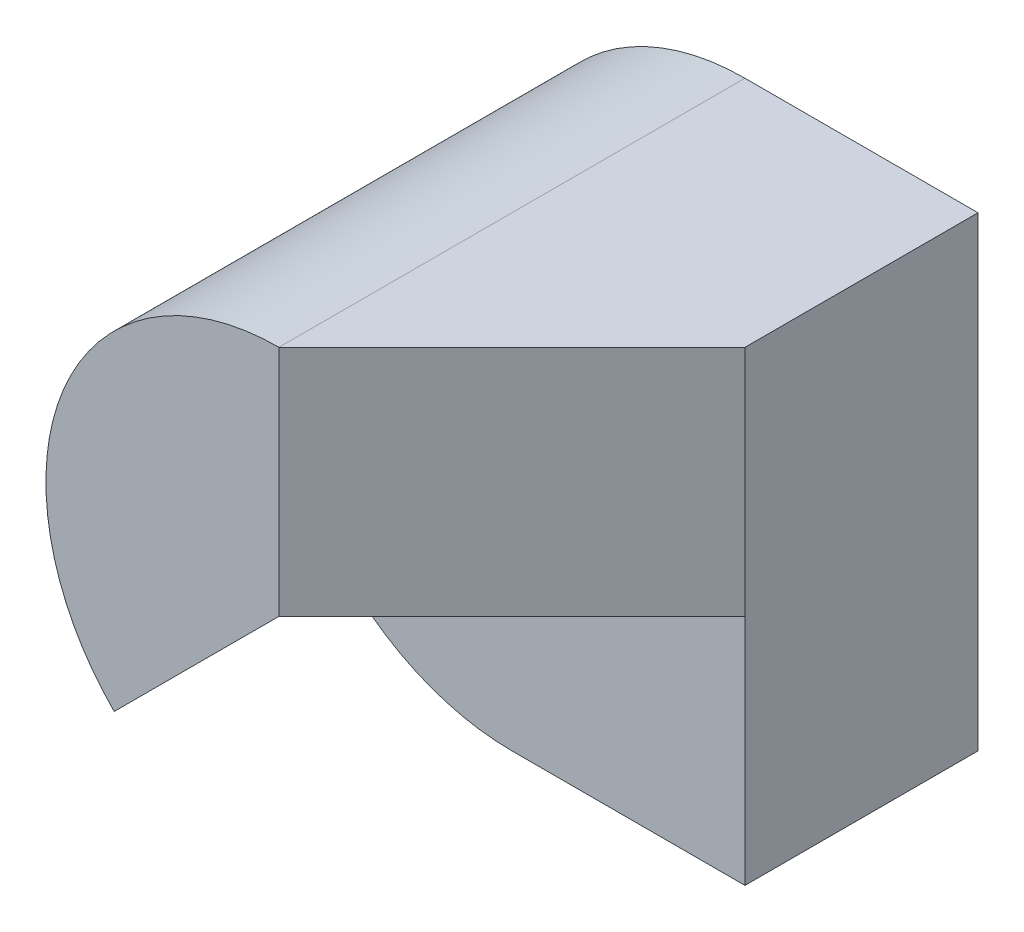
ISO-10303-21;
HEADER;
FILE_DESCRIPTION(('STEP AP214'),'2;1');
FILE_NAME('part.step','',(''),(''),'','','');
FILE_SCHEMA(('AUTOMOTIVE_DESIGN { 1 0 10303 214 1 1 1 1 }'));
ENDSEC;
DATA;
#1=APPLICATION_CONTEXT('core data for automotive mechanical design processes');
#2=APPLICATION_PROTOCOL_DEFINITION('international standard','automotive_design',2000,#1);
#3=PRODUCT_CONTEXT('',#1,'mechanical');
#4=PRODUCT('Part','Part','',(#3));
#5=PRODUCT_RELATED_PRODUCT_CATEGORY('part','',(#4));
#6=PRODUCT_DEFINITION_FORMATION('','',#4);
#7=PRODUCT_DEFINITION_CONTEXT('part definition',#1,'design');
#8=PRODUCT_DEFINITION('design','',#6,#7);
#9=PRODUCT_DEFINITION_SHAPE('','',#8);
#10=(LENGTH_UNIT() NAMED_UNIT(*) SI_UNIT(.MILLI.,.METRE.));
#11=(NAMED_UNIT(*) PLANE_ANGLE_UNIT() SI_UNIT($,.RADIAN.));
#12=(NAMED_UNIT(*) SI_UNIT($,.STERADIAN.) SOLID_ANGLE_UNIT());
#13=UNCERTAINTY_MEASURE_WITH_UNIT(LENGTH_MEASURE(1.E-05),#10,'distance_accuracy_value','');
#14=(GEOMETRIC_REPRESENTATION_CONTEXT(3) GLOBAL_UNCERTAINTY_ASSIGNED_CONTEXT((#13)) GLOBAL_UNIT_ASSIGNED_CONTEXT((#10,
#11,#12)) REPRESENTATION_CONTEXT('',''));
#15=CARTESIAN_POINT('',(0.,0.,0.));
#16=DIRECTION('',(0.,0.,1.));
#17=DIRECTION('',(1.,0.,0.));
#18=AXIS2_PLACEMENT_3D('',#15,#16,#17);
#19=CARTESIAN_POINT('',(2.00000000000001,-2.00000000000001,4.));
#20=DIRECTION('',(0.,1.,0.));
#21=DIRECTION('',(-1.,0.,0.));
#22=AXIS2_PLACEMENT_3D('',#19,#20,#21);
#23=PLANE('',#22);
#24=DIRECTION('',(1.,0.,0.));
#25=VECTOR('',#24,1.);
#26=CARTESIAN_POINT('',(-2.,-2.,2.));
#27=LINE('',#26,#25);
#28=CARTESIAN_POINT('',(0.,-2.,2.));
#29=VERTEX_POINT('',#28);
#30=CARTESIAN_POINT('',(2.00000000000001,-2.00000000000001,2.));
#31=VERTEX_POINT('',#30);
#32=EDGE_CURVE('E120',#29,#31,#27,.T.);
#33=ORIENTED_EDGE('',*,*,#32,.F.);
#34=DIRECTION('',(0.,0.,-1.));
#35=VECTOR('',#34,1.);
#36=CARTESIAN_POINT('',(0.,-2.,4.));
#37=LINE('',#36,#35);
#38=CARTESIAN_POINT('',(0.,-2.,0.));
#39=VERTEX_POINT('',#38);
#40=EDGE_CURVE('E12',#29,#39,#37,.T.);
#41=ORIENTED_EDGE('',*,*,#40,.T.);
#42=DIRECTION('',(1.,0.,0.));
#43=VECTOR('',#42,1.);
#44=CARTESIAN_POINT('',(2.00000000000001,-2.00000000000001,0.));
#45=LINE('',#44,#43);
#46=CARTESIAN_POINT('',(2.00000000000001,-2.00000000000001,0.));
#47=VERTEX_POINT('',#46);
#48=EDGE_CURVE('E139',#39,#47,#45,.T.);
#49=ORIENTED_EDGE('',*,*,#48,.T.);
#50=DIRECTION('',(0.,0.,-1.));
#51=VECTOR('',#50,1.);
#52=CARTESIAN_POINT('',(2.00000000000001,-2.00000000000001,4.));
#53=LINE('',#52,#51);
#54=EDGE_CURVE('E43',#31,#47,#53,.T.);
#55=ORIENTED_EDGE('',*,*,#54,.F.);
#56=EDGE_LOOP('',(#33,#41,#49,#55));
#57=FACE_BOUND('',#56,.T.);
#58=ADVANCED_FACE('F34',(#57),#23,.F.);
#59=CARTESIAN_POINT('',(0.,0.,4.));
#60=DIRECTION('',(0.,0.,-1.));
#61=DIRECTION('',(-1.,0.,0.));
#62=AXIS2_PLACEMENT_3D('',#59,#60,#61);
#63=CYLINDRICAL_SURFACE('',#62,1.99999999999999);
#64=CARTESIAN_POINT('',(0.,0.,2.));
#65=DIRECTION('',(0.,0.,1.));
#66=DIRECTION('',(1.,0.,0.));
#67=AXIS2_PLACEMENT_3D('',#64,#65,#66);
#68=CIRCLE('',#67,1.99999999999999);
#69=CARTESIAN_POINT('',(-1.41421356237309,-1.41421356237309,2.));
#70=VERTEX_POINT('',#69);
#71=EDGE_CURVE('E154',#70,#29,#68,.T.);
#72=ORIENTED_EDGE('',*,*,#71,.F.);
#73=DIRECTION('',(0.,0.,-1.));
#74=VECTOR('',#73,1.);
#75=CARTESIAN_POINT('',(-1.41421356237309,-1.41421356237309,4.));
#76=LINE('',#75,#74);
#77=CARTESIAN_POINT('',(-1.41421356237309,-1.41421356237309,4.));
#78=VERTEX_POINT('',#77);
#79=EDGE_CURVE('E148',#70,#78,#76,.F.);
#80=ORIENTED_EDGE('',*,*,#79,.T.);
#81=CARTESIAN_POINT('',(0.,0.,4.));
#82=DIRECTION('',(0.,0.,1.));
#83=DIRECTION('',(1.,0.,0.));
#84=AXIS2_PLACEMENT_3D('',#81,#82,#83);
#85=CIRCLE('',#84,1.99999999999999);
#86=CARTESIAN_POINT('',(0.,1.99999999999999,4.));
#87=VERTEX_POINT('',#86);
#88=EDGE_CURVE('E131',#87,#78,#85,.T.);
#89=ORIENTED_EDGE('',*,*,#88,.F.);
#90=DIRECTION('',(0.,0.,-1.));
#91=VECTOR('',#90,1.);
#92=CARTESIAN_POINT('',(0.,1.99999999999999,4.));
#93=LINE('',#92,#91);
#94=CARTESIAN_POINT('',(0.,1.99999999999999,0.));
#95=VERTEX_POINT('',#94);
#96=EDGE_CURVE('E129',#87,#95,#93,.T.);
#97=ORIENTED_EDGE('',*,*,#96,.T.);
#98=CARTESIAN_POINT('',(0.,0.,0.));
#99=DIRECTION('',(0.,0.,1.));
#100=DIRECTION('',(1.,0.,0.));
#101=AXIS2_PLACEMENT_3D('',#98,#99,#100);
#102=CIRCLE('',#101,1.99999999999999);
#103=EDGE_CURVE('E161',#95,#39,#102,.T.);
#104=ORIENTED_EDGE('',*,*,#103,.T.);
#105=ORIENTED_EDGE('',*,*,#40,.F.);
#106=EDGE_LOOP('',(#72,#80,#89,#97,#104,#105));
#107=FACE_BOUND('',#106,.T.);
#108=ADVANCED_FACE('F36',(#107),#63,.T.);
#109=CARTESIAN_POINT('',(2.00000000000001,1.99999999999999,4.));
#110=DIRECTION('',(-1.,0.,0.));
#111=DIRECTION('',(0.,0.,1.));
#112=AXIS2_PLACEMENT_3D('',#109,#110,#111);
#113=PLANE('',#112);
#114=DIRECTION('',(0.,0.,-1.));
#115=VECTOR('',#114,1.);
#116=CARTESIAN_POINT('',(2.00000000000001,1.99999999999999,4.));
#117=LINE('',#116,#115);
#118=CARTESIAN_POINT('',(2.00000000000001,1.99999999999999,2.));
#119=VERTEX_POINT('',#118);
#120=CARTESIAN_POINT('',(2.00000000000001,1.99999999999999,0.));
#121=VERTEX_POINT('',#120);
#122=EDGE_CURVE('E56',#119,#121,#117,.T.);
#123=ORIENTED_EDGE('',*,*,#122,.F.);
#124=DIRECTION('',(0.,1.,0.));
#125=VECTOR('',#124,1.);
#126=CARTESIAN_POINT('',(2.00000000000001,0.,2.));
#127=LINE('',#126,#125);
#128=CARTESIAN_POINT('',(2.00000000000001,0.,2.));
#129=VERTEX_POINT('',#128);
#130=EDGE_CURVE('E94',#129,#119,#127,.T.);
#131=ORIENTED_EDGE('',*,*,#130,.F.);
#132=DIRECTION('',(0.,1.,0.));
#133=VECTOR('',#132,1.);
#134=CARTESIAN_POINT('',(2.00000000000001,-2.00000000000001,2.));
#135=LINE('',#134,#133);
#136=EDGE_CURVE('E105',#31,#129,#135,.T.);
#137=ORIENTED_EDGE('',*,*,#136,.F.);
#138=ORIENTED_EDGE('',*,*,#54,.T.);
#139=DIRECTION('',(0.,1.,0.));
#140=VECTOR('',#139,1.);
#141=CARTESIAN_POINT('',(2.00000000000001,1.99999999999999,0.));
#142=LINE('',#141,#140);
#143=EDGE_CURVE('E137',#47,#121,#142,.T.);
#144=ORIENTED_EDGE('',*,*,#143,.T.);
#145=EDGE_LOOP('',(#123,#131,#137,#138,#144));
#146=FACE_BOUND('',#145,.T.);
#147=ADVANCED_FACE('F103',(#146),#113,.F.);
#148=CARTESIAN_POINT('',(0.,1.99999999999999,4.));
#149=DIRECTION('',(0.,-1.,0.));
#150=DIRECTION('',(1.,0.,0.));
#151=AXIS2_PLACEMENT_3D('',#148,#149,#150);
#152=PLANE('',#151);
#153=ORIENTED_EDGE('',*,*,#96,.F.);
#154=DIRECTION('',(-0.707106781186548,0.,0.707106781186547));
#155=VECTOR('',#154,1.);
#156=CARTESIAN_POINT('',(2.00000000000001,1.99999999999999,2.));
#157=LINE('',#156,#155);
#158=EDGE_CURVE('E107',#119,#87,#157,.T.);
#159=ORIENTED_EDGE('',*,*,#158,.F.);
#160=ORIENTED_EDGE('',*,*,#122,.T.);
#161=DIRECTION('',(-1.,0.,0.));
#162=VECTOR('',#161,1.);
#163=CARTESIAN_POINT('',(0.,1.99999999999999,0.));
#164=LINE('',#163,#162);
#165=EDGE_CURVE('E51',#121,#95,#164,.T.);
#166=ORIENTED_EDGE('',*,*,#165,.T.);
#167=EDGE_LOOP('',(#153,#159,#160,#166));
#168=FACE_BOUND('',#167,.T.);
#169=ADVANCED_FACE('F173',(#168),#152,.F.);
#170=CARTESIAN_POINT('',(0.,0.,4.));
#171=DIRECTION('',(0.,0.,1.));
#172=DIRECTION('',(1.,0.,0.));
#173=AXIS2_PLACEMENT_3D('',#170,#171,#172);
#174=PLANE('',#173);
#175=DIRECTION('',(0.,-1.,0.));
#176=VECTOR('',#175,1.);
#177=CARTESIAN_POINT('',(0.,1.99999999999999,4.));
#178=LINE('',#177,#176);
#179=CARTESIAN_POINT('',(0.,0.,4.));
#180=VERTEX_POINT('',#179);
#181=EDGE_CURVE('E96',#87,#180,#178,.T.);
#182=ORIENTED_EDGE('',*,*,#181,.F.);
#183=ORIENTED_EDGE('',*,*,#88,.T.);
#184=DIRECTION('',(-0.707106781186548,-0.707106781186548,0.));
#185=VECTOR('',#184,1.);
#186=CARTESIAN_POINT('',(0.,0.,4.));
#187=LINE('',#186,#185);
#188=EDGE_CURVE('E121',#180,#78,#187,.T.);
#189=ORIENTED_EDGE('',*,*,#188,.F.);
#190=EDGE_LOOP('',(#182,#183,#189));
#191=FACE_BOUND('',#190,.T.);
#192=ADVANCED_FACE('F183',(#191),#174,.T.);
#193=CARTESIAN_POINT('',(0.,0.,0.));
#194=DIRECTION('',(0.,0.,1.));
#195=DIRECTION('',(1.,0.,0.));
#196=AXIS2_PLACEMENT_3D('',#193,#194,#195);
#197=PLANE('',#196);
#198=ORIENTED_EDGE('',*,*,#103,.F.);
#199=ORIENTED_EDGE('',*,*,#165,.F.);
#200=ORIENTED_EDGE('',*,*,#143,.F.);
#201=ORIENTED_EDGE('',*,*,#48,.F.);
#202=EDGE_LOOP('',(#198,#199,#200,#201));
#203=FACE_BOUND('',#202,.T.);
#204=ADVANCED_FACE('F170',(#203),#197,.F.);
#205=CARTESIAN_POINT('',(0.,0.,2.));
#206=DIRECTION('',(0.,0.,1.));
#207=DIRECTION('',(1.,0.,0.));
#208=AXIS2_PLACEMENT_3D('',#205,#206,#207);
#209=PLANE('',#208);
#210=ORIENTED_EDGE('',*,*,#71,.T.);
#211=ORIENTED_EDGE('',*,*,#32,.T.);
#212=ORIENTED_EDGE('',*,*,#136,.T.);
#213=DIRECTION('',(-1.,0.,0.));
#214=VECTOR('',#213,1.);
#215=CARTESIAN_POINT('',(2.00000000000001,0.,2.));
#216=LINE('',#215,#214);
#217=CARTESIAN_POINT('',(0.,0.,2.));
#218=VERTEX_POINT('',#217);
#219=EDGE_CURVE('E110',#129,#218,#216,.T.);
#220=ORIENTED_EDGE('',*,*,#219,.T.);
#221=DIRECTION('',(-0.707106781186548,-0.707106781186548,0.));
#222=VECTOR('',#221,1.);
#223=CARTESIAN_POINT('',(0.,0.,2.));
#224=LINE('',#223,#222);
#225=EDGE_CURVE('E116',#218,#70,#224,.T.);
#226=ORIENTED_EDGE('',*,*,#225,.T.);
#227=EDGE_LOOP('',(#210,#211,#212,#220,#226));
#228=FACE_BOUND('',#227,.T.);
#229=ADVANCED_FACE('F118',(#228),#209,.T.);
#230=CARTESIAN_POINT('',(0.,0.,2.));
#231=DIRECTION('',(-0.707106781186547,0.707106781186547,0.));
#232=DIRECTION('',(-0.707106781186548,-0.707106781186548,0.));
#233=AXIS2_PLACEMENT_3D('',#230,#231,#232);
#234=PLANE('',#233);
#235=ORIENTED_EDGE('',*,*,#225,.F.);
#236=DIRECTION('',(0.,0.,1.));
#237=VECTOR('',#236,1.);
#238=CARTESIAN_POINT('',(0.,0.,2.));
#239=LINE('',#238,#237);
#240=EDGE_CURVE('E112',#218,#180,#239,.T.);
#241=ORIENTED_EDGE('',*,*,#240,.T.);
#242=ORIENTED_EDGE('',*,*,#188,.T.);
#243=ORIENTED_EDGE('',*,*,#79,.F.);
#244=EDGE_LOOP('',(#235,#241,#242,#243));
#245=FACE_BOUND('',#244,.T.);
#246=ADVANCED_FACE('F184',(#245),#234,.F.);
#247=CARTESIAN_POINT('',(2.00000000000001,0.,2.));
#248=DIRECTION('',(0.,1.,0.));
#249=DIRECTION('',(-1.,0.,0.));
#250=AXIS2_PLACEMENT_3D('',#247,#248,#249);
#251=PLANE('',#250);
#252=ORIENTED_EDGE('',*,*,#219,.F.);
#253=DIRECTION('',(0.707106781186549,0.,-0.707106781186546));
#254=VECTOR('',#253,1.);
#255=CARTESIAN_POINT('',(0.,0.,4.));
#256=LINE('',#255,#254);
#257=EDGE_CURVE('E91',#180,#129,#256,.T.);
#258=ORIENTED_EDGE('',*,*,#257,.F.);
#259=ORIENTED_EDGE('',*,*,#240,.F.);
#260=EDGE_LOOP('',(#252,#258,#259));
#261=FACE_BOUND('',#260,.T.);
#262=ADVANCED_FACE('F111',(#261),#251,.F.);
#263=CARTESIAN_POINT('',(2.,0.,2.00000000000001));
#264=DIRECTION('',(-0.707106781186546,0.,-0.707106781186549));
#265=DIRECTION('',(-0.707106781186549,0.,0.707106781186546));
#266=AXIS2_PLACEMENT_3D('',#263,#264,#265);
#267=PLANE('',#266);
#268=ORIENTED_EDGE('',*,*,#181,.T.);
#269=ORIENTED_EDGE('',*,*,#257,.T.);
#270=ORIENTED_EDGE('',*,*,#130,.T.);
#271=ORIENTED_EDGE('',*,*,#158,.T.);
#272=EDGE_LOOP('',(#268,#269,#270,#271));
#273=FACE_BOUND('',#272,.T.);
#274=ADVANCED_FACE('F93',(#273),#267,.F.);
#275=CLOSED_SHELL('',(#58,#108,#147,#169,#192,#204,#229,#246,#262,#274));
#276=MANIFOLD_SOLID_BREP('B2',#275);
#277=ADVANCED_BREP_SHAPE_REPRESENTATION('',(#18,#276),#14);
#278=SHAPE_DEFINITION_REPRESENTATION(#9,#277);
ENDSEC;
END-ISO-10303-21;
